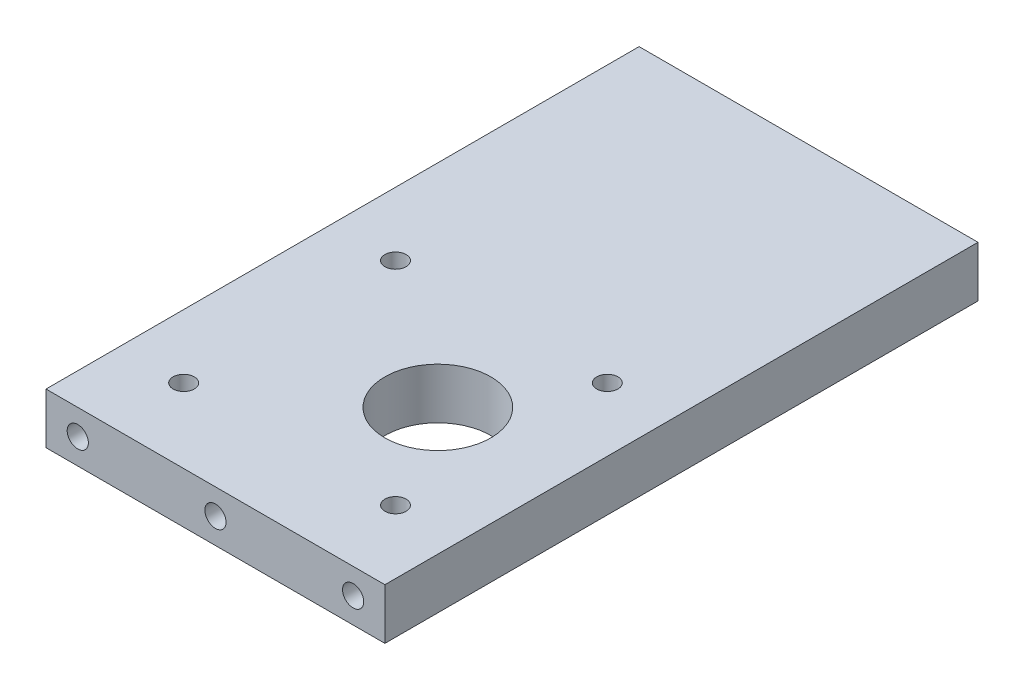
ISO-10303-21;
HEADER;
FILE_DESCRIPTION(('STEP AP214'),'2;1');
FILE_NAME('part.step','',(''),(''),'','','');
FILE_SCHEMA(('AUTOMOTIVE_DESIGN { 1 0 10303 214 1 1 1 1 }'));
ENDSEC;
DATA;
#1=APPLICATION_CONTEXT('core data for automotive mechanical design processes');
#2=APPLICATION_PROTOCOL_DEFINITION('international standard','automotive_design',2000,#1);
#3=PRODUCT_CONTEXT('',#1,'mechanical');
#4=PRODUCT('Part','Part','',(#3));
#5=PRODUCT_RELATED_PRODUCT_CATEGORY('part','',(#4));
#6=PRODUCT_DEFINITION_FORMATION('','',#4);
#7=PRODUCT_DEFINITION_CONTEXT('part definition',#1,'design');
#8=PRODUCT_DEFINITION('design','',#6,#7);
#9=PRODUCT_DEFINITION_SHAPE('','',#8);
#10=(LENGTH_UNIT() NAMED_UNIT(*) SI_UNIT(.MILLI.,.METRE.));
#11=(NAMED_UNIT(*) PLANE_ANGLE_UNIT() SI_UNIT($,.RADIAN.));
#12=(NAMED_UNIT(*) SI_UNIT($,.STERADIAN.) SOLID_ANGLE_UNIT());
#13=UNCERTAINTY_MEASURE_WITH_UNIT(LENGTH_MEASURE(1.E-05),#10,'distance_accuracy_value','');
#14=(GEOMETRIC_REPRESENTATION_CONTEXT(3) GLOBAL_UNCERTAINTY_ASSIGNED_CONTEXT((#13)) GLOBAL_UNIT_ASSIGNED_CONTEXT((#10,
#11,#12)) REPRESENTATION_CONTEXT('',''));
#15=CARTESIAN_POINT('',(0.,0.,0.));
#16=DIRECTION('',(0.,0.,1.));
#17=DIRECTION('',(1.,0.,0.));
#18=AXIS2_PLACEMENT_3D('',#15,#16,#17);
#19=CARTESIAN_POINT('',(0.,6.,0.));
#20=DIRECTION('',(0.,1.,0.));
#21=DIRECTION('',(0.,0.,1.));
#22=AXIS2_PLACEMENT_3D('',#19,#20,#21);
#23=PLANE('',#22);
#24=CARTESIAN_POINT('',(-25.,6.,-67.5));
#25=DIRECTION('',(0.,1.,0.));
#26=DIRECTION('',(0.,0.,1.));
#27=AXIS2_PLACEMENT_3D('',#24,#25,#26);
#28=CIRCLE('',#27,2.5);
#29=CARTESIAN_POINT('',(-25.,6.,-65.));
#30=VERTEX_POINT('',#29);
#31=EDGE_CURVE('E182',#30,#30,#28,.T.);
#32=ORIENTED_EDGE('',*,*,#31,.F.);
#33=EDGE_LOOP('',(#32));
#34=FACE_BOUND('',#33,.T.);
#35=CARTESIAN_POINT('',(25.,6.,-67.5));
#36=DIRECTION('',(0.,1.,0.));
#37=DIRECTION('',(0.,0.,1.));
#38=AXIS2_PLACEMENT_3D('',#35,#36,#37);
#39=CIRCLE('',#38,2.5);
#40=CARTESIAN_POINT('',(25.,6.,-65.));
#41=VERTEX_POINT('',#40);
#42=EDGE_CURVE('E188',#41,#41,#39,.T.);
#43=ORIENTED_EDGE('',*,*,#42,.F.);
#44=EDGE_LOOP('',(#43));
#45=FACE_BOUND('',#44,.T.);
#46=CARTESIAN_POINT('',(25.,6.,-17.5));
#47=DIRECTION('',(0.,1.,0.));
#48=DIRECTION('',(0.,0.,1.));
#49=AXIS2_PLACEMENT_3D('',#46,#47,#48);
#50=CIRCLE('',#49,2.5);
#51=CARTESIAN_POINT('',(25.,6.,-15.));
#52=VERTEX_POINT('',#51);
#53=EDGE_CURVE('E194',#52,#52,#50,.T.);
#54=ORIENTED_EDGE('',*,*,#53,.F.);
#55=EDGE_LOOP('',(#54));
#56=FACE_BOUND('',#55,.T.);
#57=CARTESIAN_POINT('',(-25.,6.,-17.5));
#58=DIRECTION('',(0.,1.,0.));
#59=DIRECTION('',(0.,0.,1.));
#60=AXIS2_PLACEMENT_3D('',#57,#58,#59);
#61=CIRCLE('',#60,2.5);
#62=CARTESIAN_POINT('',(-25.,6.,-15.));
#63=VERTEX_POINT('',#62);
#64=EDGE_CURVE('E200',#63,#63,#61,.T.);
#65=ORIENTED_EDGE('',*,*,#64,.F.);
#66=EDGE_LOOP('',(#65));
#67=FACE_BOUND('',#66,.T.);
#68=DIRECTION('',(0.,0.,1.));
#69=VECTOR('',#68,1.);
#70=CARTESIAN_POINT('',(-40.,6.,-140.));
#71=LINE('',#70,#69);
#72=CARTESIAN_POINT('',(-40.,6.,-140.));
#73=VERTEX_POINT('',#72);
#74=CARTESIAN_POINT('',(-40.,6.,0.));
#75=VERTEX_POINT('',#74);
#76=EDGE_CURVE('E213',#73,#75,#71,.T.);
#77=ORIENTED_EDGE('',*,*,#76,.T.);
#78=DIRECTION('',(1.,0.,0.));
#79=VECTOR('',#78,1.);
#80=CARTESIAN_POINT('',(-40.,6.,0.));
#81=LINE('',#80,#79);
#82=CARTESIAN_POINT('',(40.,6.,0.));
#83=VERTEX_POINT('',#82);
#84=EDGE_CURVE('E82',#75,#83,#81,.T.);
#85=ORIENTED_EDGE('',*,*,#84,.T.);
#86=DIRECTION('',(0.,0.,-1.));
#87=VECTOR('',#86,1.);
#88=CARTESIAN_POINT('',(40.,6.,-140.));
#89=LINE('',#88,#87);
#90=CARTESIAN_POINT('',(40.,6.,-140.));
#91=VERTEX_POINT('',#90);
#92=EDGE_CURVE('E216',#83,#91,#89,.T.);
#93=ORIENTED_EDGE('',*,*,#92,.T.);
#94=DIRECTION('',(-1.,0.,0.));
#95=VECTOR('',#94,1.);
#96=CARTESIAN_POINT('',(-40.,6.,-140.));
#97=LINE('',#96,#95);
#98=EDGE_CURVE('E51',#91,#73,#97,.T.);
#99=ORIENTED_EDGE('',*,*,#98,.T.);
#100=EDGE_LOOP('',(#77,#85,#93,#99));
#101=FACE_BOUND('',#100,.T.);
#102=CARTESIAN_POINT('',(10.,6.,-42.5));
#103=DIRECTION('',(0.,1.,0.));
#104=DIRECTION('',(0.,0.,1.));
#105=AXIS2_PLACEMENT_3D('',#102,#103,#104);
#106=CIRCLE('',#105,12.5);
#107=CARTESIAN_POINT('',(10.,6.,-30.));
#108=VERTEX_POINT('',#107);
#109=EDGE_CURVE('E207',#108,#108,#106,.T.);
#110=ORIENTED_EDGE('',*,*,#109,.F.);
#111=EDGE_LOOP('',(#110));
#112=FACE_BOUND('',#111,.T.);
#113=ADVANCED_FACE('F34',(#34,#45,#56,#67,#101,#112),#23,.T.);
#114=CARTESIAN_POINT('',(0.,-6.,0.));
#115=DIRECTION('',(0.,1.,0.));
#116=DIRECTION('',(0.,0.,1.));
#117=AXIS2_PLACEMENT_3D('',#114,#115,#116);
#118=PLANE('',#117);
#119=CARTESIAN_POINT('',(-25.,-6.,-67.5));
#120=DIRECTION('',(0.,1.,0.));
#121=DIRECTION('',(0.,0.,1.));
#122=AXIS2_PLACEMENT_3D('',#119,#120,#121);
#123=CIRCLE('',#122,2.5);
#124=CARTESIAN_POINT('',(-25.,-6.,-65.));
#125=VERTEX_POINT('',#124);
#126=EDGE_CURVE('E185',#125,#125,#123,.T.);
#127=ORIENTED_EDGE('',*,*,#126,.T.);
#128=EDGE_LOOP('',(#127));
#129=FACE_BOUND('',#128,.T.);
#130=CARTESIAN_POINT('',(25.,-6.,-67.5));
#131=DIRECTION('',(0.,1.,0.));
#132=DIRECTION('',(0.,0.,1.));
#133=AXIS2_PLACEMENT_3D('',#130,#131,#132);
#134=CIRCLE('',#133,2.5);
#135=CARTESIAN_POINT('',(25.,-6.,-65.));
#136=VERTEX_POINT('',#135);
#137=EDGE_CURVE('E191',#136,#136,#134,.T.);
#138=ORIENTED_EDGE('',*,*,#137,.T.);
#139=EDGE_LOOP('',(#138));
#140=FACE_BOUND('',#139,.T.);
#141=CARTESIAN_POINT('',(25.,-6.,-17.5));
#142=DIRECTION('',(0.,1.,0.));
#143=DIRECTION('',(0.,0.,1.));
#144=AXIS2_PLACEMENT_3D('',#141,#142,#143);
#145=CIRCLE('',#144,2.5);
#146=CARTESIAN_POINT('',(25.,-6.,-15.));
#147=VERTEX_POINT('',#146);
#148=EDGE_CURVE('E197',#147,#147,#145,.T.);
#149=ORIENTED_EDGE('',*,*,#148,.T.);
#150=EDGE_LOOP('',(#149));
#151=FACE_BOUND('',#150,.T.);
#152=CARTESIAN_POINT('',(-25.,-6.,-17.5));
#153=DIRECTION('',(0.,1.,0.));
#154=DIRECTION('',(0.,0.,1.));
#155=AXIS2_PLACEMENT_3D('',#152,#153,#154);
#156=CIRCLE('',#155,2.5);
#157=CARTESIAN_POINT('',(-25.,-6.,-15.));
#158=VERTEX_POINT('',#157);
#159=EDGE_CURVE('E203',#158,#158,#156,.T.);
#160=ORIENTED_EDGE('',*,*,#159,.T.);
#161=EDGE_LOOP('',(#160));
#162=FACE_BOUND('',#161,.T.);
#163=DIRECTION('',(0.,0.,1.));
#164=VECTOR('',#163,1.);
#165=CARTESIAN_POINT('',(-40.,-6.,-140.));
#166=LINE('',#165,#164);
#167=CARTESIAN_POINT('',(-40.,-6.,-140.));
#168=VERTEX_POINT('',#167);
#169=CARTESIAN_POINT('',(-40.,-6.,0.));
#170=VERTEX_POINT('',#169);
#171=EDGE_CURVE('E210',#168,#170,#166,.T.);
#172=ORIENTED_EDGE('',*,*,#171,.F.);
#173=DIRECTION('',(-1.,0.,0.));
#174=VECTOR('',#173,1.);
#175=CARTESIAN_POINT('',(-40.,-6.,-140.));
#176=LINE('',#175,#174);
#177=CARTESIAN_POINT('',(40.,-6.,-140.));
#178=VERTEX_POINT('',#177);
#179=EDGE_CURVE('E75',#178,#168,#176,.T.);
#180=ORIENTED_EDGE('',*,*,#179,.F.);
#181=DIRECTION('',(0.,0.,-1.));
#182=VECTOR('',#181,1.);
#183=CARTESIAN_POINT('',(40.,-6.,-140.));
#184=LINE('',#183,#182);
#185=CARTESIAN_POINT('',(40.,-6.,0.));
#186=VERTEX_POINT('',#185);
#187=EDGE_CURVE('E69',#186,#178,#184,.T.);
#188=ORIENTED_EDGE('',*,*,#187,.F.);
#189=DIRECTION('',(1.,0.,0.));
#190=VECTOR('',#189,1.);
#191=CARTESIAN_POINT('',(-40.,-6.,0.));
#192=LINE('',#191,#190);
#193=EDGE_CURVE('E222',#170,#186,#192,.T.);
#194=ORIENTED_EDGE('',*,*,#193,.F.);
#195=EDGE_LOOP('',(#172,#180,#188,#194));
#196=FACE_BOUND('',#195,.T.);
#197=CARTESIAN_POINT('',(10.,-6.,-42.5));
#198=DIRECTION('',(0.,1.,0.));
#199=DIRECTION('',(0.,0.,1.));
#200=AXIS2_PLACEMENT_3D('',#197,#198,#199);
#201=CIRCLE('',#200,12.5);
#202=CARTESIAN_POINT('',(10.,-6.,-30.));
#203=VERTEX_POINT('',#202);
#204=EDGE_CURVE('E206',#203,#203,#201,.T.);
#205=ORIENTED_EDGE('',*,*,#204,.T.);
#206=EDGE_LOOP('',(#205));
#207=FACE_BOUND('',#206,.T.);
#208=ADVANCED_FACE('F232',(#129,#140,#151,#162,#196,#207),#118,.F.);
#209=CARTESIAN_POINT('',(-40.,6.,-140.));
#210=DIRECTION('',(1.,0.,0.));
#211=DIRECTION('',(0.,0.,-1.));
#212=AXIS2_PLACEMENT_3D('',#209,#210,#211);
#213=PLANE('',#212);
#214=CARTESIAN_POINT('',(-40.,0.,-113.));
#215=DIRECTION('',(-1.,0.,0.));
#216=DIRECTION('',(0.,0.,1.));
#217=AXIS2_PLACEMENT_3D('',#214,#215,#216);
#218=CIRCLE('',#217,2.49999999999999);
#219=CARTESIAN_POINT('',(-40.,0.,-110.5));
#220=VERTEX_POINT('',#219);
#221=EDGE_CURVE('E124',#220,#220,#218,.T.);
#222=ORIENTED_EDGE('',*,*,#221,.F.);
#223=EDGE_LOOP('',(#222));
#224=FACE_BOUND('',#223,.T.);
#225=CARTESIAN_POINT('',(-40.,0.,-86.));
#226=DIRECTION('',(-1.,0.,0.));
#227=DIRECTION('',(0.,0.,1.));
#228=AXIS2_PLACEMENT_3D('',#225,#226,#227);
#229=CIRCLE('',#228,2.49999999999999);
#230=CARTESIAN_POINT('',(-40.,0.,-83.5));
#231=VERTEX_POINT('',#230);
#232=EDGE_CURVE('E123',#231,#231,#229,.T.);
#233=ORIENTED_EDGE('',*,*,#232,.F.);
#234=EDGE_LOOP('',(#233));
#235=FACE_BOUND('',#234,.T.);
#236=CARTESIAN_POINT('',(-40.,0.,-56.));
#237=DIRECTION('',(-1.,0.,0.));
#238=DIRECTION('',(0.,0.,1.));
#239=AXIS2_PLACEMENT_3D('',#236,#237,#238);
#240=CIRCLE('',#239,2.49999999999999);
#241=CARTESIAN_POINT('',(-40.,0.,-53.5));
#242=VERTEX_POINT('',#241);
#243=EDGE_CURVE('E134',#242,#242,#240,.T.);
#244=ORIENTED_EDGE('',*,*,#243,.F.);
#245=EDGE_LOOP('',(#244));
#246=FACE_BOUND('',#245,.T.);
#247=CARTESIAN_POINT('',(-40.,0.,-29.));
#248=DIRECTION('',(-1.,0.,0.));
#249=DIRECTION('',(0.,0.,1.));
#250=AXIS2_PLACEMENT_3D('',#247,#248,#249);
#251=CIRCLE('',#250,2.49999999999999);
#252=CARTESIAN_POINT('',(-40.,0.,-26.5));
#253=VERTEX_POINT('',#252);
#254=EDGE_CURVE('E140',#253,#253,#251,.T.);
#255=ORIENTED_EDGE('',*,*,#254,.F.);
#256=EDGE_LOOP('',(#255));
#257=FACE_BOUND('',#256,.T.);
#258=ORIENTED_EDGE('',*,*,#171,.T.);
#259=DIRECTION('',(0.,-1.,0.));
#260=VECTOR('',#259,1.);
#261=CARTESIAN_POINT('',(-40.,6.,0.));
#262=LINE('',#261,#260);
#263=EDGE_CURVE('E11',#75,#170,#262,.T.);
#264=ORIENTED_EDGE('',*,*,#263,.F.);
#265=ORIENTED_EDGE('',*,*,#76,.F.);
#266=DIRECTION('',(0.,-1.,0.));
#267=VECTOR('',#266,1.);
#268=CARTESIAN_POINT('',(-40.,6.,-140.));
#269=LINE('',#268,#267);
#270=EDGE_CURVE('E219',#73,#168,#269,.T.);
#271=ORIENTED_EDGE('',*,*,#270,.T.);
#272=EDGE_LOOP('',(#258,#264,#265,#271));
#273=FACE_BOUND('',#272,.T.);
#274=ADVANCED_FACE('F36',(#224,#235,#246,#257,#273),#213,.F.);
#275=CARTESIAN_POINT('',(-40.,6.,0.));
#276=DIRECTION('',(0.,0.,-1.));
#277=DIRECTION('',(-1.,0.,0.));
#278=AXIS2_PLACEMENT_3D('',#275,#276,#277);
#279=PLANE('',#278);
#280=CARTESIAN_POINT('',(32.5,0.,0.));
#281=DIRECTION('',(0.,0.,1.));
#282=DIRECTION('',(1.,0.,0.));
#283=AXIS2_PLACEMENT_3D('',#280,#281,#282);
#284=CIRCLE('',#283,2.5);
#285=CARTESIAN_POINT('',(35.,0.,0.));
#286=VERTEX_POINT('',#285);
#287=EDGE_CURVE('E164',#286,#286,#284,.T.);
#288=ORIENTED_EDGE('',*,*,#287,.F.);
#289=EDGE_LOOP('',(#288));
#290=FACE_BOUND('',#289,.T.);
#291=CARTESIAN_POINT('',(0.,0.,0.));
#292=DIRECTION('',(0.,0.,1.));
#293=DIRECTION('',(1.,0.,0.));
#294=AXIS2_PLACEMENT_3D('',#291,#292,#293);
#295=CIRCLE('',#294,2.5);
#296=CARTESIAN_POINT('',(2.5,0.,0.));
#297=VERTEX_POINT('',#296);
#298=EDGE_CURVE('E170',#297,#297,#295,.T.);
#299=ORIENTED_EDGE('',*,*,#298,.F.);
#300=EDGE_LOOP('',(#299));
#301=FACE_BOUND('',#300,.T.);
#302=CARTESIAN_POINT('',(-32.5,0.,0.));
#303=DIRECTION('',(0.,0.,1.));
#304=DIRECTION('',(1.,0.,0.));
#305=AXIS2_PLACEMENT_3D('',#302,#303,#304);
#306=CIRCLE('',#305,2.5);
#307=CARTESIAN_POINT('',(-30.,0.,0.));
#308=VERTEX_POINT('',#307);
#309=EDGE_CURVE('E176',#308,#308,#306,.T.);
#310=ORIENTED_EDGE('',*,*,#309,.F.);
#311=EDGE_LOOP('',(#310));
#312=FACE_BOUND('',#311,.T.);
#313=ORIENTED_EDGE('',*,*,#193,.T.);
#314=DIRECTION('',(0.,-1.,0.));
#315=VECTOR('',#314,1.);
#316=CARTESIAN_POINT('',(40.,6.,0.));
#317=LINE('',#316,#315);
#318=EDGE_CURVE('E43',#83,#186,#317,.T.);
#319=ORIENTED_EDGE('',*,*,#318,.F.);
#320=ORIENTED_EDGE('',*,*,#84,.F.);
#321=ORIENTED_EDGE('',*,*,#263,.T.);
#322=EDGE_LOOP('',(#313,#319,#320,#321));
#323=FACE_BOUND('',#322,.T.);
#324=ADVANCED_FACE('F249',(#290,#301,#312,#323),#279,.F.);
#325=CARTESIAN_POINT('',(40.,6.,-140.));
#326=DIRECTION('',(-1.,0.,0.));
#327=DIRECTION('',(0.,0.,1.));
#328=AXIS2_PLACEMENT_3D('',#325,#326,#327);
#329=PLANE('',#328);
#330=ORIENTED_EDGE('',*,*,#187,.T.);
#331=DIRECTION('',(0.,-1.,0.));
#332=VECTOR('',#331,1.);
#333=CARTESIAN_POINT('',(40.,6.,-140.));
#334=LINE('',#333,#332);
#335=EDGE_CURVE('E227',#91,#178,#334,.T.);
#336=ORIENTED_EDGE('',*,*,#335,.F.);
#337=ORIENTED_EDGE('',*,*,#92,.F.);
#338=ORIENTED_EDGE('',*,*,#318,.T.);
#339=EDGE_LOOP('',(#330,#336,#337,#338));
#340=FACE_BOUND('',#339,.T.);
#341=ADVANCED_FACE('F229',(#340),#329,.F.);
#342=CARTESIAN_POINT('',(-40.,6.,-140.));
#343=DIRECTION('',(0.,0.,1.));
#344=DIRECTION('',(1.,0.,0.));
#345=AXIS2_PLACEMENT_3D('',#342,#343,#344);
#346=PLANE('',#345);
#347=CARTESIAN_POINT('',(32.5,0.,-140.));
#348=DIRECTION('',(0.,0.,-1.));
#349=DIRECTION('',(-1.,0.,0.));
#350=AXIS2_PLACEMENT_3D('',#347,#348,#349);
#351=CIRCLE('',#350,2.5);
#352=CARTESIAN_POINT('',(30.,0.,-140.));
#353=VERTEX_POINT('',#352);
#354=EDGE_CURVE('E146',#353,#353,#351,.T.);
#355=ORIENTED_EDGE('',*,*,#354,.F.);
#356=EDGE_LOOP('',(#355));
#357=FACE_BOUND('',#356,.T.);
#358=CARTESIAN_POINT('',(0.,0.,-140.));
#359=DIRECTION('',(0.,0.,-1.));
#360=DIRECTION('',(-1.,0.,0.));
#361=AXIS2_PLACEMENT_3D('',#358,#359,#360);
#362=CIRCLE('',#361,2.5);
#363=CARTESIAN_POINT('',(-2.5,0.,-140.));
#364=VERTEX_POINT('',#363);
#365=EDGE_CURVE('E152',#364,#364,#362,.T.);
#366=ORIENTED_EDGE('',*,*,#365,.F.);
#367=EDGE_LOOP('',(#366));
#368=FACE_BOUND('',#367,.T.);
#369=CARTESIAN_POINT('',(-32.5,0.,-140.));
#370=DIRECTION('',(0.,0.,-1.));
#371=DIRECTION('',(-1.,0.,0.));
#372=AXIS2_PLACEMENT_3D('',#369,#370,#371);
#373=CIRCLE('',#372,2.5);
#374=CARTESIAN_POINT('',(-35.,0.,-140.));
#375=VERTEX_POINT('',#374);
#376=EDGE_CURVE('E158',#375,#375,#373,.T.);
#377=ORIENTED_EDGE('',*,*,#376,.F.);
#378=EDGE_LOOP('',(#377));
#379=FACE_BOUND('',#378,.T.);
#380=ORIENTED_EDGE('',*,*,#179,.T.);
#381=ORIENTED_EDGE('',*,*,#270,.F.);
#382=ORIENTED_EDGE('',*,*,#98,.F.);
#383=ORIENTED_EDGE('',*,*,#335,.T.);
#384=EDGE_LOOP('',(#380,#381,#382,#383));
#385=FACE_BOUND('',#384,.T.);
#386=ADVANCED_FACE('F237',(#357,#368,#379,#385),#346,.F.);
#387=CARTESIAN_POINT('',(10.,6.,-42.5));
#388=DIRECTION('',(0.,-1.,0.));
#389=DIRECTION('',(0.,0.,-1.));
#390=AXIS2_PLACEMENT_3D('',#387,#388,#389);
#391=CYLINDRICAL_SURFACE('',#390,12.5);
#392=ORIENTED_EDGE('',*,*,#109,.T.);
#393=EDGE_LOOP('',(#392));
#394=FACE_BOUND('',#393,.T.);
#395=ORIENTED_EDGE('',*,*,#204,.F.);
#396=EDGE_LOOP('',(#395));
#397=FACE_BOUND('',#396,.T.);
#398=ADVANCED_FACE('F239',(#394,#397),#391,.F.);
#399=CARTESIAN_POINT('',(-25.,6.,-17.5));
#400=DIRECTION('',(0.,1.,0.));
#401=DIRECTION('',(0.,0.,1.));
#402=AXIS2_PLACEMENT_3D('',#399,#400,#401);
#403=CYLINDRICAL_SURFACE('',#402,2.5);
#404=ORIENTED_EDGE('',*,*,#159,.F.);
#405=EDGE_LOOP('',(#404));
#406=FACE_BOUND('',#405,.T.);
#407=ORIENTED_EDGE('',*,*,#64,.T.);
#408=EDGE_LOOP('',(#407));
#409=FACE_BOUND('',#408,.T.);
#410=ADVANCED_FACE('F246',(#406,#409),#403,.F.);
#411=CARTESIAN_POINT('',(25.,6.,-17.5));
#412=DIRECTION('',(0.,1.,0.));
#413=DIRECTION('',(0.,0.,1.));
#414=AXIS2_PLACEMENT_3D('',#411,#412,#413);
#415=CYLINDRICAL_SURFACE('',#414,2.5);
#416=ORIENTED_EDGE('',*,*,#148,.F.);
#417=EDGE_LOOP('',(#416));
#418=FACE_BOUND('',#417,.T.);
#419=ORIENTED_EDGE('',*,*,#53,.T.);
#420=EDGE_LOOP('',(#419));
#421=FACE_BOUND('',#420,.T.);
#422=ADVANCED_FACE('F266',(#418,#421),#415,.F.);
#423=CARTESIAN_POINT('',(25.,6.,-67.5));
#424=DIRECTION('',(0.,1.,0.));
#425=DIRECTION('',(0.,0.,1.));
#426=AXIS2_PLACEMENT_3D('',#423,#424,#425);
#427=CYLINDRICAL_SURFACE('',#426,2.5);
#428=ORIENTED_EDGE('',*,*,#137,.F.);
#429=EDGE_LOOP('',(#428));
#430=FACE_BOUND('',#429,.T.);
#431=ORIENTED_EDGE('',*,*,#42,.T.);
#432=EDGE_LOOP('',(#431));
#433=FACE_BOUND('',#432,.T.);
#434=ADVANCED_FACE('F270',(#430,#433),#427,.F.);
#435=CARTESIAN_POINT('',(-25.,6.,-67.5));
#436=DIRECTION('',(0.,1.,0.));
#437=DIRECTION('',(0.,0.,1.));
#438=AXIS2_PLACEMENT_3D('',#435,#436,#437);
#439=CYLINDRICAL_SURFACE('',#438,2.5);
#440=ORIENTED_EDGE('',*,*,#126,.F.);
#441=EDGE_LOOP('',(#440));
#442=FACE_BOUND('',#441,.T.);
#443=ORIENTED_EDGE('',*,*,#31,.T.);
#444=EDGE_LOOP('',(#443));
#445=FACE_BOUND('',#444,.T.);
#446=ADVANCED_FACE('F274',(#442,#445),#439,.F.);
#447=CARTESIAN_POINT('',(-32.5,0.,-20.));
#448=DIRECTION('',(0.,0.,1.));
#449=DIRECTION('',(1.,0.,0.));
#450=AXIS2_PLACEMENT_3D('',#447,#448,#449);
#451=CONICAL_SURFACE('',#450,2.5,1.02974425867665);
#452=CARTESIAN_POINT('',(-32.5,0.,-21.5021515475689));
#453=VERTEX_POINT('',#452);
#454=VERTEX_LOOP('',#453);
#455=FACE_BOUND('',#454,.T.);
#456=CARTESIAN_POINT('',(-32.5,0.,-20.));
#457=DIRECTION('',(0.,0.,1.));
#458=DIRECTION('',(1.,0.,0.));
#459=AXIS2_PLACEMENT_3D('',#456,#457,#458);
#460=CIRCLE('',#459,2.5);
#461=CARTESIAN_POINT('',(-30.,0.,-20.));
#462=VERTEX_POINT('',#461);
#463=EDGE_CURVE('E179',#462,#462,#460,.T.);
#464=ORIENTED_EDGE('',*,*,#463,.T.);
#465=EDGE_LOOP('',(#464));
#466=FACE_BOUND('',#465,.T.);
#467=ADVANCED_FACE('F278',(#455,#466),#451,.F.);
#468=CARTESIAN_POINT('',(-32.5,0.,0.));
#469=DIRECTION('',(0.,0.,1.));
#470=DIRECTION('',(1.,0.,0.));
#471=AXIS2_PLACEMENT_3D('',#468,#469,#470);
#472=CYLINDRICAL_SURFACE('',#471,2.5);
#473=ORIENTED_EDGE('',*,*,#463,.F.);
#474=EDGE_LOOP('',(#473));
#475=FACE_BOUND('',#474,.T.);
#476=ORIENTED_EDGE('',*,*,#309,.T.);
#477=EDGE_LOOP('',(#476));
#478=FACE_BOUND('',#477,.T.);
#479=ADVANCED_FACE('F282',(#475,#478),#472,.F.);
#480=CARTESIAN_POINT('',(0.,0.,-20.));
#481=DIRECTION('',(0.,0.,1.));
#482=DIRECTION('',(1.,0.,0.));
#483=AXIS2_PLACEMENT_3D('',#480,#481,#482);
#484=CONICAL_SURFACE('',#483,2.5,1.02974425867665);
#485=CARTESIAN_POINT('',(0.,0.,-21.5021515475689));
#486=VERTEX_POINT('',#485);
#487=VERTEX_LOOP('',#486);
#488=FACE_BOUND('',#487,.T.);
#489=CARTESIAN_POINT('',(0.,0.,-20.));
#490=DIRECTION('',(0.,0.,1.));
#491=DIRECTION('',(1.,0.,0.));
#492=AXIS2_PLACEMENT_3D('',#489,#490,#491);
#493=CIRCLE('',#492,2.5);
#494=CARTESIAN_POINT('',(2.5,0.,-20.));
#495=VERTEX_POINT('',#494);
#496=EDGE_CURVE('E173',#495,#495,#493,.T.);
#497=ORIENTED_EDGE('',*,*,#496,.T.);
#498=EDGE_LOOP('',(#497));
#499=FACE_BOUND('',#498,.T.);
#500=ADVANCED_FACE('F286',(#488,#499),#484,.F.);
#501=CARTESIAN_POINT('',(0.,0.,0.));
#502=DIRECTION('',(0.,0.,1.));
#503=DIRECTION('',(1.,0.,0.));
#504=AXIS2_PLACEMENT_3D('',#501,#502,#503);
#505=CYLINDRICAL_SURFACE('',#504,2.5);
#506=ORIENTED_EDGE('',*,*,#496,.F.);
#507=EDGE_LOOP('',(#506));
#508=FACE_BOUND('',#507,.T.);
#509=ORIENTED_EDGE('',*,*,#298,.T.);
#510=EDGE_LOOP('',(#509));
#511=FACE_BOUND('',#510,.T.);
#512=ADVANCED_FACE('F290',(#508,#511),#505,.F.);
#513=CARTESIAN_POINT('',(32.5,0.,-20.));
#514=DIRECTION('',(0.,0.,1.));
#515=DIRECTION('',(1.,0.,0.));
#516=AXIS2_PLACEMENT_3D('',#513,#514,#515);
#517=CONICAL_SURFACE('',#516,2.5,1.02974425867665);
#518=CARTESIAN_POINT('',(32.5,0.,-21.5021515475689));
#519=VERTEX_POINT('',#518);
#520=VERTEX_LOOP('',#519);
#521=FACE_BOUND('',#520,.T.);
#522=CARTESIAN_POINT('',(32.5,0.,-20.));
#523=DIRECTION('',(0.,0.,1.));
#524=DIRECTION('',(1.,0.,0.));
#525=AXIS2_PLACEMENT_3D('',#522,#523,#524);
#526=CIRCLE('',#525,2.5);
#527=CARTESIAN_POINT('',(35.,0.,-20.));
#528=VERTEX_POINT('',#527);
#529=EDGE_CURVE('E167',#528,#528,#526,.T.);
#530=ORIENTED_EDGE('',*,*,#529,.T.);
#531=EDGE_LOOP('',(#530));
#532=FACE_BOUND('',#531,.T.);
#533=ADVANCED_FACE('F294',(#521,#532),#517,.F.);
#534=CARTESIAN_POINT('',(32.5,0.,0.));
#535=DIRECTION('',(0.,0.,1.));
#536=DIRECTION('',(1.,0.,0.));
#537=AXIS2_PLACEMENT_3D('',#534,#535,#536);
#538=CYLINDRICAL_SURFACE('',#537,2.5);
#539=ORIENTED_EDGE('',*,*,#529,.F.);
#540=EDGE_LOOP('',(#539));
#541=FACE_BOUND('',#540,.T.);
#542=ORIENTED_EDGE('',*,*,#287,.T.);
#543=EDGE_LOOP('',(#542));
#544=FACE_BOUND('',#543,.T.);
#545=ADVANCED_FACE('F298',(#541,#544),#538,.F.);
#546=CARTESIAN_POINT('',(-32.5,0.,-120.));
#547=DIRECTION('',(0.,0.,-1.));
#548=DIRECTION('',(-1.,0.,0.));
#549=AXIS2_PLACEMENT_3D('',#546,#547,#548);
#550=CONICAL_SURFACE('',#549,2.5,1.02974425867665);
#551=CARTESIAN_POINT('',(-32.5,0.,-118.497848452431));
#552=VERTEX_POINT('',#551);
#553=VERTEX_LOOP('',#552);
#554=FACE_BOUND('',#553,.T.);
#555=CARTESIAN_POINT('',(-32.5,0.,-120.));
#556=DIRECTION('',(0.,0.,-1.));
#557=DIRECTION('',(-1.,0.,0.));
#558=AXIS2_PLACEMENT_3D('',#555,#556,#557);
#559=CIRCLE('',#558,2.5);
#560=CARTESIAN_POINT('',(-35.,0.,-120.));
#561=VERTEX_POINT('',#560);
#562=EDGE_CURVE('E161',#561,#561,#559,.T.);
#563=ORIENTED_EDGE('',*,*,#562,.T.);
#564=EDGE_LOOP('',(#563));
#565=FACE_BOUND('',#564,.T.);
#566=ADVANCED_FACE('F302',(#554,#565),#550,.F.);
#567=CARTESIAN_POINT('',(-32.5,0.,-140.));
#568=DIRECTION('',(0.,0.,-1.));
#569=DIRECTION('',(-1.,0.,0.));
#570=AXIS2_PLACEMENT_3D('',#567,#568,#569);
#571=CYLINDRICAL_SURFACE('',#570,2.5);
#572=ORIENTED_EDGE('',*,*,#562,.F.);
#573=EDGE_LOOP('',(#572));
#574=FACE_BOUND('',#573,.T.);
#575=ORIENTED_EDGE('',*,*,#376,.T.);
#576=EDGE_LOOP('',(#575));
#577=FACE_BOUND('',#576,.T.);
#578=ADVANCED_FACE('F306',(#574,#577),#571,.F.);
#579=CARTESIAN_POINT('',(0.,0.,-120.));
#580=DIRECTION('',(0.,0.,-1.));
#581=DIRECTION('',(-1.,0.,0.));
#582=AXIS2_PLACEMENT_3D('',#579,#580,#581);
#583=CONICAL_SURFACE('',#582,2.5,1.02974425867665);
#584=CARTESIAN_POINT('',(0.,0.,-118.497848452431));
#585=VERTEX_POINT('',#584);
#586=VERTEX_LOOP('',#585);
#587=FACE_BOUND('',#586,.T.);
#588=CARTESIAN_POINT('',(0.,0.,-120.));
#589=DIRECTION('',(0.,0.,-1.));
#590=DIRECTION('',(-1.,0.,0.));
#591=AXIS2_PLACEMENT_3D('',#588,#589,#590);
#592=CIRCLE('',#591,2.5);
#593=CARTESIAN_POINT('',(-2.5,0.,-120.));
#594=VERTEX_POINT('',#593);
#595=EDGE_CURVE('E155',#594,#594,#592,.T.);
#596=ORIENTED_EDGE('',*,*,#595,.T.);
#597=EDGE_LOOP('',(#596));
#598=FACE_BOUND('',#597,.T.);
#599=ADVANCED_FACE('F310',(#587,#598),#583,.F.);
#600=CARTESIAN_POINT('',(0.,0.,-140.));
#601=DIRECTION('',(0.,0.,-1.));
#602=DIRECTION('',(-1.,0.,0.));
#603=AXIS2_PLACEMENT_3D('',#600,#601,#602);
#604=CYLINDRICAL_SURFACE('',#603,2.5);
#605=ORIENTED_EDGE('',*,*,#595,.F.);
#606=EDGE_LOOP('',(#605));
#607=FACE_BOUND('',#606,.T.);
#608=ORIENTED_EDGE('',*,*,#365,.T.);
#609=EDGE_LOOP('',(#608));
#610=FACE_BOUND('',#609,.T.);
#611=ADVANCED_FACE('F314',(#607,#610),#604,.F.);
#612=CARTESIAN_POINT('',(32.5,0.,-120.));
#613=DIRECTION('',(0.,0.,-1.));
#614=DIRECTION('',(-1.,0.,0.));
#615=AXIS2_PLACEMENT_3D('',#612,#613,#614);
#616=CONICAL_SURFACE('',#615,2.5,1.02974425867665);
#617=CARTESIAN_POINT('',(32.5,0.,-118.497848452431));
#618=VERTEX_POINT('',#617);
#619=VERTEX_LOOP('',#618);
#620=FACE_BOUND('',#619,.T.);
#621=CARTESIAN_POINT('',(32.5,0.,-120.));
#622=DIRECTION('',(0.,0.,-1.));
#623=DIRECTION('',(-1.,0.,0.));
#624=AXIS2_PLACEMENT_3D('',#621,#622,#623);
#625=CIRCLE('',#624,2.5);
#626=CARTESIAN_POINT('',(30.,0.,-120.));
#627=VERTEX_POINT('',#626);
#628=EDGE_CURVE('E149',#627,#627,#625,.T.);
#629=ORIENTED_EDGE('',*,*,#628,.T.);
#630=EDGE_LOOP('',(#629));
#631=FACE_BOUND('',#630,.T.);
#632=ADVANCED_FACE('F318',(#620,#631),#616,.F.);
#633=CARTESIAN_POINT('',(32.5,0.,-140.));
#634=DIRECTION('',(0.,0.,-1.));
#635=DIRECTION('',(-1.,0.,0.));
#636=AXIS2_PLACEMENT_3D('',#633,#634,#635);
#637=CYLINDRICAL_SURFACE('',#636,2.5);
#638=ORIENTED_EDGE('',*,*,#628,.F.);
#639=EDGE_LOOP('',(#638));
#640=FACE_BOUND('',#639,.T.);
#641=ORIENTED_EDGE('',*,*,#354,.T.);
#642=EDGE_LOOP('',(#641));
#643=FACE_BOUND('',#642,.T.);
#644=ADVANCED_FACE('F322',(#640,#643),#637,.F.);
#645=CARTESIAN_POINT('',(-14.,0.,-29.));
#646=DIRECTION('',(-1.,0.,0.));
#647=DIRECTION('',(0.,0.,1.));
#648=AXIS2_PLACEMENT_3D('',#645,#646,#647);
#649=CONICAL_SURFACE('',#648,2.49999999999999,1.02974425867665);
#650=CARTESIAN_POINT('',(-12.4978484524311,0.,-29.));
#651=VERTEX_POINT('',#650);
#652=VERTEX_LOOP('',#651);
#653=FACE_BOUND('',#652,.T.);
#654=CARTESIAN_POINT('',(-14.,0.,-29.));
#655=DIRECTION('',(-1.,0.,0.));
#656=DIRECTION('',(0.,0.,1.));
#657=AXIS2_PLACEMENT_3D('',#654,#655,#656);
#658=CIRCLE('',#657,2.49999999999999);
#659=CARTESIAN_POINT('',(-14.,0.,-26.5));
#660=VERTEX_POINT('',#659);
#661=EDGE_CURVE('E143',#660,#660,#658,.T.);
#662=ORIENTED_EDGE('',*,*,#661,.T.);
#663=EDGE_LOOP('',(#662));
#664=FACE_BOUND('',#663,.T.);
#665=ADVANCED_FACE('F326',(#653,#664),#649,.F.);
#666=CARTESIAN_POINT('',(-40.,0.,-29.));
#667=DIRECTION('',(-1.,0.,0.));
#668=DIRECTION('',(0.,0.,1.));
#669=AXIS2_PLACEMENT_3D('',#666,#667,#668);
#670=CYLINDRICAL_SURFACE('',#669,2.49999999999999);
#671=ORIENTED_EDGE('',*,*,#661,.F.);
#672=EDGE_LOOP('',(#671));
#673=FACE_BOUND('',#672,.T.);
#674=ORIENTED_EDGE('',*,*,#254,.T.);
#675=EDGE_LOOP('',(#674));
#676=FACE_BOUND('',#675,.T.);
#677=ADVANCED_FACE('F330',(#673,#676),#670,.F.);
#678=CARTESIAN_POINT('',(-14.,0.,-56.));
#679=DIRECTION('',(-1.,0.,0.));
#680=DIRECTION('',(0.,0.,1.));
#681=AXIS2_PLACEMENT_3D('',#678,#679,#680);
#682=CONICAL_SURFACE('',#681,2.49999999999999,1.02974425867665);
#683=CARTESIAN_POINT('',(-12.4978484524311,0.,-56.));
#684=VERTEX_POINT('',#683);
#685=VERTEX_LOOP('',#684);
#686=FACE_BOUND('',#685,.T.);
#687=CARTESIAN_POINT('',(-14.,0.,-56.));
#688=DIRECTION('',(-1.,0.,0.));
#689=DIRECTION('',(0.,0.,1.));
#690=AXIS2_PLACEMENT_3D('',#687,#688,#689);
#691=CIRCLE('',#690,2.49999999999999);
#692=CARTESIAN_POINT('',(-14.,0.,-53.5));
#693=VERTEX_POINT('',#692);
#694=EDGE_CURVE('E137',#693,#693,#691,.T.);
#695=ORIENTED_EDGE('',*,*,#694,.T.);
#696=EDGE_LOOP('',(#695));
#697=FACE_BOUND('',#696,.T.);
#698=ADVANCED_FACE('F334',(#686,#697),#682,.F.);
#699=CARTESIAN_POINT('',(-40.,0.,-56.));
#700=DIRECTION('',(-1.,0.,0.));
#701=DIRECTION('',(0.,0.,1.));
#702=AXIS2_PLACEMENT_3D('',#699,#700,#701);
#703=CYLINDRICAL_SURFACE('',#702,2.49999999999999);
#704=ORIENTED_EDGE('',*,*,#694,.F.);
#705=EDGE_LOOP('',(#704));
#706=FACE_BOUND('',#705,.T.);
#707=ORIENTED_EDGE('',*,*,#243,.T.);
#708=EDGE_LOOP('',(#707));
#709=FACE_BOUND('',#708,.T.);
#710=ADVANCED_FACE('F338',(#706,#709),#703,.F.);
#711=CARTESIAN_POINT('',(-14.,0.,-86.));
#712=DIRECTION('',(-1.,0.,0.));
#713=DIRECTION('',(0.,0.,1.));
#714=AXIS2_PLACEMENT_3D('',#711,#712,#713);
#715=CONICAL_SURFACE('',#714,2.49999999999999,1.02974425867665);
#716=CARTESIAN_POINT('',(-12.4978484524311,0.,-86.));
#717=VERTEX_POINT('',#716);
#718=VERTEX_LOOP('',#717);
#719=FACE_BOUND('',#718,.T.);
#720=CARTESIAN_POINT('',(-14.,0.,-86.));
#721=DIRECTION('',(-1.,0.,0.));
#722=DIRECTION('',(0.,0.,1.));
#723=AXIS2_PLACEMENT_3D('',#720,#721,#722);
#724=CIRCLE('',#723,2.49999999999999);
#725=CARTESIAN_POINT('',(-14.,0.,-83.5));
#726=VERTEX_POINT('',#725);
#727=EDGE_CURVE('E127',#726,#726,#724,.T.);
#728=ORIENTED_EDGE('',*,*,#727,.T.);
#729=EDGE_LOOP('',(#728));
#730=FACE_BOUND('',#729,.T.);
#731=ADVANCED_FACE('F342',(#719,#730),#715,.F.);
#732=CARTESIAN_POINT('',(-40.,0.,-86.));
#733=DIRECTION('',(-1.,0.,0.));
#734=DIRECTION('',(0.,0.,1.));
#735=AXIS2_PLACEMENT_3D('',#732,#733,#734);
#736=CYLINDRICAL_SURFACE('',#735,2.49999999999999);
#737=ORIENTED_EDGE('',*,*,#727,.F.);
#738=EDGE_LOOP('',(#737));
#739=FACE_BOUND('',#738,.T.);
#740=ORIENTED_EDGE('',*,*,#232,.T.);
#741=EDGE_LOOP('',(#740));
#742=FACE_BOUND('',#741,.T.);
#743=ADVANCED_FACE('F117',(#739,#742),#736,.F.);
#744=CARTESIAN_POINT('',(-14.,0.,-113.));
#745=DIRECTION('',(-1.,0.,0.));
#746=DIRECTION('',(0.,0.,1.));
#747=AXIS2_PLACEMENT_3D('',#744,#745,#746);
#748=CONICAL_SURFACE('',#747,2.49999999999999,1.02974425867665);
#749=CARTESIAN_POINT('',(-12.4978484524311,0.,-113.));
#750=VERTEX_POINT('',#749);
#751=VERTEX_LOOP('',#750);
#752=FACE_BOUND('',#751,.T.);
#753=CARTESIAN_POINT('',(-14.,0.,-113.));
#754=DIRECTION('',(-1.,0.,0.));
#755=DIRECTION('',(0.,0.,1.));
#756=AXIS2_PLACEMENT_3D('',#753,#754,#755);
#757=CIRCLE('',#756,2.49999999999999);
#758=CARTESIAN_POINT('',(-14.,0.,-110.5));
#759=VERTEX_POINT('',#758);
#760=EDGE_CURVE('E121',#759,#759,#757,.T.);
#761=ORIENTED_EDGE('',*,*,#760,.T.);
#762=EDGE_LOOP('',(#761));
#763=FACE_BOUND('',#762,.T.);
#764=ADVANCED_FACE('F113',(#752,#763),#748,.F.);
#765=CARTESIAN_POINT('',(-40.,0.,-113.));
#766=DIRECTION('',(-1.,0.,0.));
#767=DIRECTION('',(0.,0.,1.));
#768=AXIS2_PLACEMENT_3D('',#765,#766,#767);
#769=CYLINDRICAL_SURFACE('',#768,2.49999999999999);
#770=ORIENTED_EDGE('',*,*,#760,.F.);
#771=EDGE_LOOP('',(#770));
#772=FACE_BOUND('',#771,.T.);
#773=ORIENTED_EDGE('',*,*,#221,.T.);
#774=EDGE_LOOP('',(#773));
#775=FACE_BOUND('',#774,.T.);
#776=ADVANCED_FACE('F116',(#772,#775),#769,.F.);
#777=CLOSED_SHELL('',(#113,#208,#274,#324,#341,#386,#398,#410,#422,#434,#446,#467,#479,#500,
#512,#533,#545,#566,#578,#599,#611,#632,#644,#665,#677,#698,#710,#731,#743,#764,#776));
#778=MANIFOLD_SOLID_BREP('B2',#777);
#779=ADVANCED_BREP_SHAPE_REPRESENTATION('',(#18,#778),#14);
#780=SHAPE_DEFINITION_REPRESENTATION(#9,#779);
ENDSEC;
END-ISO-10303-21;
